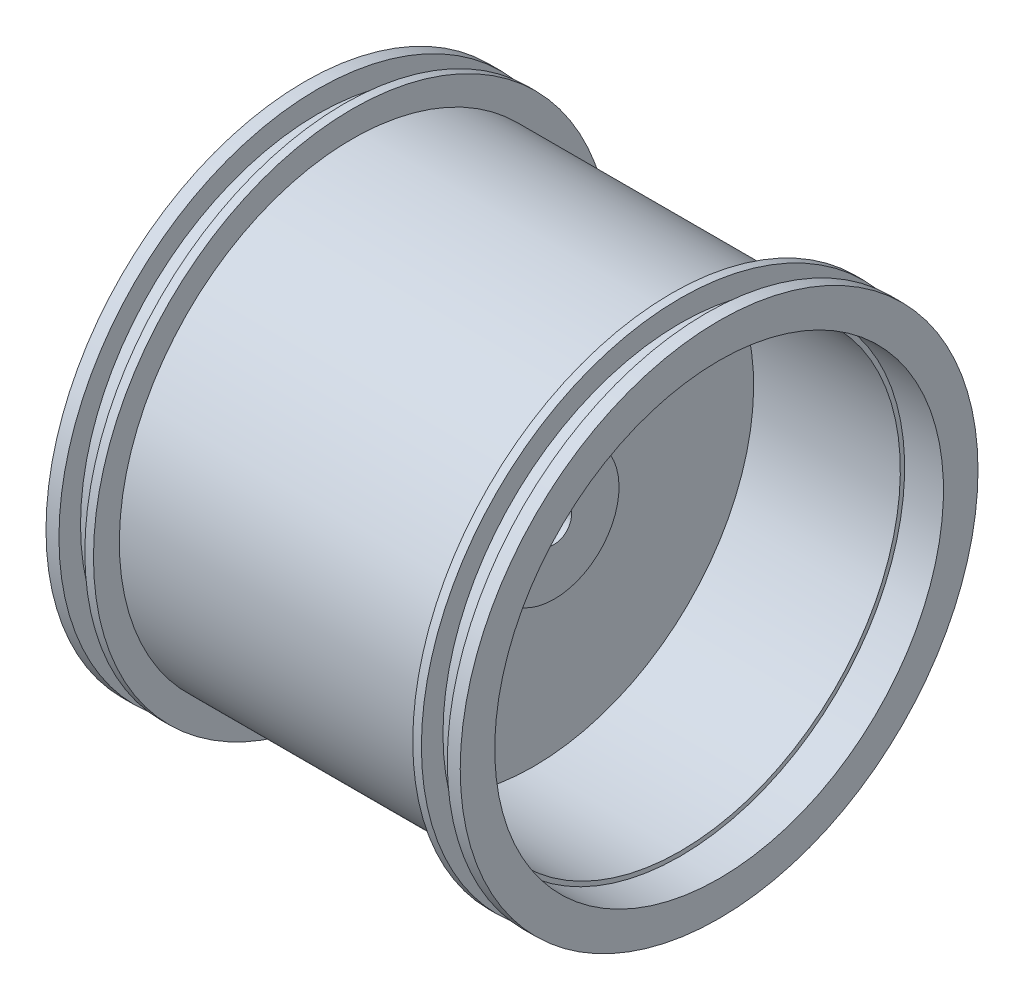
ISO-10303-21;
HEADER;
FILE_DESCRIPTION(('STEP AP214'),'2;1');
FILE_NAME('part.step','',(''),(''),'','','');
FILE_SCHEMA(('AUTOMOTIVE_DESIGN { 1 0 10303 214 1 1 1 1 }'));
ENDSEC;
DATA;
#1=APPLICATION_CONTEXT('core data for automotive mechanical design processes');
#2=APPLICATION_PROTOCOL_DEFINITION('international standard','automotive_design',2000,#1);
#3=PRODUCT_CONTEXT('',#1,'mechanical');
#4=PRODUCT('Part','Part','',(#3));
#5=PRODUCT_RELATED_PRODUCT_CATEGORY('part','',(#4));
#6=PRODUCT_DEFINITION_FORMATION('','',#4);
#7=PRODUCT_DEFINITION_CONTEXT('part definition',#1,'design');
#8=PRODUCT_DEFINITION('design','',#6,#7);
#9=PRODUCT_DEFINITION_SHAPE('','',#8);
#10=(LENGTH_UNIT() NAMED_UNIT(*) SI_UNIT(.MILLI.,.METRE.));
#11=(NAMED_UNIT(*) PLANE_ANGLE_UNIT() SI_UNIT($,.RADIAN.));
#12=(NAMED_UNIT(*) SI_UNIT($,.STERADIAN.) SOLID_ANGLE_UNIT());
#13=UNCERTAINTY_MEASURE_WITH_UNIT(LENGTH_MEASURE(1.E-05),#10,'distance_accuracy_value','');
#14=(GEOMETRIC_REPRESENTATION_CONTEXT(3) GLOBAL_UNCERTAINTY_ASSIGNED_CONTEXT((#13)) GLOBAL_UNIT_ASSIGNED_CONTEXT((#10,
#11,#12)) REPRESENTATION_CONTEXT('',''));
#15=CARTESIAN_POINT('',(0.,0.,0.));
#16=DIRECTION('',(0.,0.,1.));
#17=DIRECTION('',(1.,0.,0.));
#18=AXIS2_PLACEMENT_3D('',#15,#16,#17);
#19=CARTESIAN_POINT('',(-24.001,0.,0.));
#20=DIRECTION('',(1.,0.,0.));
#21=DIRECTION('',(0.,1.,0.));
#22=AXIS2_PLACEMENT_3D('',#19,#20,#21);
#23=CYLINDRICAL_SURFACE('',#22,2.);
#24=CARTESIAN_POINT('',(4.9,0.,0.));
#25=DIRECTION('',(1.,0.,0.));
#26=DIRECTION('',(0.,1.,0.));
#27=AXIS2_PLACEMENT_3D('',#24,#25,#26);
#28=CIRCLE('',#27,2.);
#29=CARTESIAN_POINT('',(4.9,2.,0.));
#30=VERTEX_POINT('',#29);
#31=EDGE_CURVE('E225',#30,#30,#28,.T.);
#32=ORIENTED_EDGE('',*,*,#31,.T.);
#33=EDGE_LOOP('',(#32));
#34=FACE_BOUND('',#33,.T.);
#35=CARTESIAN_POINT('',(-4.9,0.,0.));
#36=DIRECTION('',(-1.,0.,0.));
#37=DIRECTION('',(0.,0.,1.));
#38=AXIS2_PLACEMENT_3D('',#35,#36,#37);
#39=CIRCLE('',#38,2.);
#40=CARTESIAN_POINT('',(-4.9,0.,2.));
#41=VERTEX_POINT('',#40);
#42=EDGE_CURVE('E38',#41,#41,#39,.F.);
#43=ORIENTED_EDGE('',*,*,#42,.F.);
#44=EDGE_LOOP('',(#43));
#45=FACE_BOUND('',#44,.T.);
#46=ADVANCED_FACE('F34',(#34,#45),#23,.F.);
#47=CARTESIAN_POINT('',(-2.5,-21.838918543533,0.));
#48=DIRECTION('',(1.,0.,0.));
#49=DIRECTION('',(0.,1.,0.));
#50=AXIS2_PLACEMENT_3D('',#47,#48,#49);
#51=PLANE('',#50);
#52=CARTESIAN_POINT('',(-2.5,0.,0.));
#53=DIRECTION('',(-1.,0.,0.));
#54=DIRECTION('',(0.,-1.,0.));
#55=AXIS2_PLACEMENT_3D('',#52,#53,#54);
#56=CIRCLE('',#55,25.5);
#57=CARTESIAN_POINT('',(-2.50000000000001,-25.5,0.));
#58=VERTEX_POINT('',#57);
#59=EDGE_CURVE('E228',#58,#58,#56,.T.);
#60=ORIENTED_EDGE('',*,*,#59,.T.);
#61=EDGE_LOOP('',(#60));
#62=FACE_BOUND('',#61,.T.);
#63=DIRECTION('',(0.,0.5,-0.866025403784439));
#64=VECTOR('',#63,1.);
#65=CARTESIAN_POINT('',(-2.5,4.12805442470583,7.15));
#66=LINE('',#65,#64);
#67=CARTESIAN_POINT('',(-2.5,4.12805442470583,7.15));
#68=VERTEX_POINT('',#67);
#69=CARTESIAN_POINT('',(-2.5,8.25610884941166,0.));
#70=VERTEX_POINT('',#69);
#71=EDGE_CURVE('E194',#68,#70,#66,.T.);
#72=ORIENTED_EDGE('',*,*,#71,.F.);
#73=DIRECTION('',(0.,1.,0.));
#74=VECTOR('',#73,1.);
#75=CARTESIAN_POINT('',(-2.5,-4.12805442470582,7.15));
#76=LINE('',#75,#74);
#77=CARTESIAN_POINT('',(-2.5,-4.12805442470582,7.15));
#78=VERTEX_POINT('',#77);
#79=EDGE_CURVE('E183',#78,#68,#76,.T.);
#80=ORIENTED_EDGE('',*,*,#79,.F.);
#81=DIRECTION('',(0.,0.5,0.866025403784439));
#82=VECTOR('',#81,1.);
#83=CARTESIAN_POINT('',(-2.5,-8.25610884941165,0.));
#84=LINE('',#83,#82);
#85=CARTESIAN_POINT('',(-2.5,-8.25610884941165,0.));
#86=VERTEX_POINT('',#85);
#87=EDGE_CURVE('E204',#86,#78,#84,.T.);
#88=ORIENTED_EDGE('',*,*,#87,.F.);
#89=DIRECTION('',(0.,-0.5,0.866025403784438));
#90=VECTOR('',#89,1.);
#91=CARTESIAN_POINT('',(-2.5,-4.12805442470582,-7.15));
#92=LINE('',#91,#90);
#93=CARTESIAN_POINT('',(-2.5,-4.12805442470583,-7.15));
#94=VERTEX_POINT('',#93);
#95=EDGE_CURVE('E201',#94,#86,#92,.T.);
#96=ORIENTED_EDGE('',*,*,#95,.F.);
#97=DIRECTION('',(0.,-1.,0.));
#98=VECTOR('',#97,1.);
#99=CARTESIAN_POINT('',(-2.5,4.12805442470582,-7.15));
#100=LINE('',#99,#98);
#101=CARTESIAN_POINT('',(-2.5,4.12805442470582,-7.15));
#102=VERTEX_POINT('',#101);
#103=EDGE_CURVE('E198',#102,#94,#100,.T.);
#104=ORIENTED_EDGE('',*,*,#103,.F.);
#105=DIRECTION('',(0.,-0.5,-0.866025403784438));
#106=VECTOR('',#105,1.);
#107=CARTESIAN_POINT('',(-2.5,8.25610884941165,0.));
#108=LINE('',#107,#106);
#109=EDGE_CURVE('E58',#70,#102,#108,.T.);
#110=ORIENTED_EDGE('',*,*,#109,.F.);
#111=EDGE_LOOP('',(#72,#80,#88,#96,#104,#110));
#112=FACE_BOUND('',#111,.T.);
#113=ADVANCED_FACE('F36',(#62,#112),#51,.F.);
#114=CARTESIAN_POINT('',(4.9,-21.838918543533,0.));
#115=DIRECTION('',(-1.,0.,0.));
#116=DIRECTION('',(0.,-1.,0.));
#117=AXIS2_PLACEMENT_3D('',#114,#115,#116);
#118=PLANE('',#117);
#119=ORIENTED_EDGE('',*,*,#31,.F.);
#120=EDGE_LOOP('',(#119));
#121=FACE_BOUND('',#120,.T.);
#122=CARTESIAN_POINT('',(4.9,0.,0.));
#123=DIRECTION('',(-1.,0.,0.));
#124=DIRECTION('',(0.,-1.,0.));
#125=AXIS2_PLACEMENT_3D('',#122,#123,#124);
#126=CIRCLE('',#125,7.5);
#127=CARTESIAN_POINT('',(4.9,-7.5,0.));
#128=VERTEX_POINT('',#127);
#129=EDGE_CURVE('E11',#128,#128,#126,.T.);
#130=ORIENTED_EDGE('',*,*,#129,.F.);
#131=EDGE_LOOP('',(#130));
#132=FACE_BOUND('',#131,.T.);
#133=ADVANCED_FACE('F302',(#121,#132),#118,.F.);
#134=CARTESIAN_POINT('',(-2.5,0.,0.));
#135=DIRECTION('',(-1.,0.,0.));
#136=DIRECTION('',(0.,-1.,0.));
#137=AXIS2_PLACEMENT_3D('',#134,#135,#136);
#138=CYLINDRICAL_SURFACE('',#137,7.5);
#139=CARTESIAN_POINT('',(2.5,0.,0.));
#140=DIRECTION('',(-1.,0.,0.));
#141=DIRECTION('',(0.,-1.,0.));
#142=AXIS2_PLACEMENT_3D('',#139,#140,#141);
#143=CIRCLE('',#142,7.5);
#144=CARTESIAN_POINT('',(2.5,-7.5,0.));
#145=VERTEX_POINT('',#144);
#146=EDGE_CURVE('E43',#145,#145,#143,.T.);
#147=ORIENTED_EDGE('',*,*,#146,.F.);
#148=EDGE_LOOP('',(#147));
#149=FACE_BOUND('',#148,.T.);
#150=ORIENTED_EDGE('',*,*,#129,.T.);
#151=EDGE_LOOP('',(#150));
#152=FACE_BOUND('',#151,.T.);
#153=ADVANCED_FACE('F299',(#149,#152),#138,.T.);
#154=CARTESIAN_POINT('',(2.5,-21.838918543533,0.));
#155=DIRECTION('',(-1.,0.,0.));
#156=DIRECTION('',(0.,-1.,0.));
#157=AXIS2_PLACEMENT_3D('',#154,#155,#156);
#158=PLANE('',#157);
#159=CARTESIAN_POINT('',(2.5,0.,0.));
#160=DIRECTION('',(-1.,0.,0.));
#161=DIRECTION('',(0.,-1.,0.));
#162=AXIS2_PLACEMENT_3D('',#159,#160,#161);
#163=CIRCLE('',#162,25.5);
#164=CARTESIAN_POINT('',(2.5,-25.5,0.));
#165=VERTEX_POINT('',#164);
#166=EDGE_CURVE('E291',#165,#165,#163,.T.);
#167=ORIENTED_EDGE('',*,*,#166,.F.);
#168=EDGE_LOOP('',(#167));
#169=FACE_BOUND('',#168,.T.);
#170=ORIENTED_EDGE('',*,*,#146,.T.);
#171=EDGE_LOOP('',(#170));
#172=FACE_BOUND('',#171,.T.);
#173=ADVANCED_FACE('F297',(#169,#172),#158,.F.);
#174=CARTESIAN_POINT('',(-2.5,0.,0.));
#175=DIRECTION('',(-1.,0.,0.));
#176=DIRECTION('',(0.,-1.,0.));
#177=AXIS2_PLACEMENT_3D('',#174,#175,#176);
#178=CYLINDRICAL_SURFACE('',#177,25.5);
#179=CARTESIAN_POINT('',(19.5,0.,0.));
#180=DIRECTION('',(-1.,0.,0.));
#181=DIRECTION('',(0.,-1.,0.));
#182=AXIS2_PLACEMENT_3D('',#179,#180,#181);
#183=CIRCLE('',#182,25.5);
#184=CARTESIAN_POINT('',(19.5,-25.5,0.));
#185=VERTEX_POINT('',#184);
#186=EDGE_CURVE('E288',#185,#185,#183,.T.);
#187=ORIENTED_EDGE('',*,*,#186,.F.);
#188=EDGE_LOOP('',(#187));
#189=FACE_BOUND('',#188,.T.);
#190=ORIENTED_EDGE('',*,*,#166,.T.);
#191=EDGE_LOOP('',(#190));
#192=FACE_BOUND('',#191,.T.);
#193=ADVANCED_FACE('F403',(#189,#192),#178,.F.);
#194=CARTESIAN_POINT('',(19.5,-21.838918543533,0.));
#195=DIRECTION('',(-1.,0.,0.));
#196=DIRECTION('',(0.,-1.,0.));
#197=AXIS2_PLACEMENT_3D('',#194,#195,#196);
#198=PLANE('',#197);
#199=CARTESIAN_POINT('',(19.5,0.,0.));
#200=DIRECTION('',(-1.,0.,0.));
#201=DIRECTION('',(0.,-1.,0.));
#202=AXIS2_PLACEMENT_3D('',#199,#200,#201);
#203=CIRCLE('',#202,26.);
#204=CARTESIAN_POINT('',(19.5,-26.,0.));
#205=VERTEX_POINT('',#204);
#206=EDGE_CURVE('E285',#205,#205,#203,.T.);
#207=ORIENTED_EDGE('',*,*,#206,.F.);
#208=EDGE_LOOP('',(#207));
#209=FACE_BOUND('',#208,.T.);
#210=ORIENTED_EDGE('',*,*,#186,.T.);
#211=EDGE_LOOP('',(#210));
#212=FACE_BOUND('',#211,.T.);
#213=ADVANCED_FACE('F399',(#209,#212),#198,.F.);
#214=CARTESIAN_POINT('',(-2.5,0.,0.));
#215=DIRECTION('',(-1.,0.,0.));
#216=DIRECTION('',(0.,-1.,0.));
#217=AXIS2_PLACEMENT_3D('',#214,#215,#216);
#218=CYLINDRICAL_SURFACE('',#217,26.);
#219=CARTESIAN_POINT('',(24.,0.,0.));
#220=DIRECTION('',(-1.,0.,0.));
#221=DIRECTION('',(0.,-1.,0.));
#222=AXIS2_PLACEMENT_3D('',#219,#220,#221);
#223=CIRCLE('',#222,26.);
#224=CARTESIAN_POINT('',(24.,-26.,0.));
#225=VERTEX_POINT('',#224);
#226=EDGE_CURVE('E282',#225,#225,#223,.T.);
#227=ORIENTED_EDGE('',*,*,#226,.F.);
#228=EDGE_LOOP('',(#227));
#229=FACE_BOUND('',#228,.T.);
#230=ORIENTED_EDGE('',*,*,#206,.T.);
#231=EDGE_LOOP('',(#230));
#232=FACE_BOUND('',#231,.T.);
#233=ADVANCED_FACE('F395',(#229,#232),#218,.F.);
#234=CARTESIAN_POINT('',(24.,-21.838918543533,0.));
#235=DIRECTION('',(-1.,0.,0.));
#236=DIRECTION('',(0.,-1.,0.));
#237=AXIS2_PLACEMENT_3D('',#234,#235,#236);
#238=PLANE('',#237);
#239=CARTESIAN_POINT('',(24.,0.,0.));
#240=DIRECTION('',(-1.,0.,0.));
#241=DIRECTION('',(0.,-1.,0.));
#242=AXIS2_PLACEMENT_3D('',#239,#240,#241);
#243=CIRCLE('',#242,30.);
#244=CARTESIAN_POINT('',(24.,-30.,0.));
#245=VERTEX_POINT('',#244);
#246=EDGE_CURVE('E279',#245,#245,#243,.T.);
#247=ORIENTED_EDGE('',*,*,#246,.F.);
#248=EDGE_LOOP('',(#247));
#249=FACE_BOUND('',#248,.T.);
#250=ORIENTED_EDGE('',*,*,#226,.T.);
#251=EDGE_LOOP('',(#250));
#252=FACE_BOUND('',#251,.T.);
#253=ADVANCED_FACE('F391',(#249,#252),#238,.F.);
#254=CARTESIAN_POINT('',(-2.5,0.,0.));
#255=DIRECTION('',(-1.,0.,0.));
#256=DIRECTION('',(0.,-1.,0.));
#257=AXIS2_PLACEMENT_3D('',#254,#255,#256);
#258=CYLINDRICAL_SURFACE('',#257,30.);
#259=CARTESIAN_POINT('',(22.5,0.,0.));
#260=DIRECTION('',(-1.,0.,0.));
#261=DIRECTION('',(0.,-1.,0.));
#262=AXIS2_PLACEMENT_3D('',#259,#260,#261);
#263=CIRCLE('',#262,30.);
#264=CARTESIAN_POINT('',(22.5,-30.,0.));
#265=VERTEX_POINT('',#264);
#266=EDGE_CURVE('E276',#265,#265,#263,.T.);
#267=ORIENTED_EDGE('',*,*,#266,.F.);
#268=EDGE_LOOP('',(#267));
#269=FACE_BOUND('',#268,.T.);
#270=ORIENTED_EDGE('',*,*,#246,.T.);
#271=EDGE_LOOP('',(#270));
#272=FACE_BOUND('',#271,.T.);
#273=ADVANCED_FACE('F387',(#269,#272),#258,.T.);
#274=CARTESIAN_POINT('',(22.5,-21.838918543533,0.));
#275=DIRECTION('',(1.,0.,0.));
#276=DIRECTION('',(0.,1.,0.));
#277=AXIS2_PLACEMENT_3D('',#274,#275,#276);
#278=PLANE('',#277);
#279=CARTESIAN_POINT('',(22.5,0.,0.));
#280=DIRECTION('',(-1.,0.,0.));
#281=DIRECTION('',(0.,-1.,0.));
#282=AXIS2_PLACEMENT_3D('',#279,#280,#281);
#283=CIRCLE('',#282,27.5);
#284=CARTESIAN_POINT('',(22.5,-27.5,0.));
#285=VERTEX_POINT('',#284);
#286=EDGE_CURVE('E273',#285,#285,#283,.T.);
#287=ORIENTED_EDGE('',*,*,#286,.F.);
#288=EDGE_LOOP('',(#287));
#289=FACE_BOUND('',#288,.T.);
#290=ORIENTED_EDGE('',*,*,#266,.T.);
#291=EDGE_LOOP('',(#290));
#292=FACE_BOUND('',#291,.T.);
#293=ADVANCED_FACE('F383',(#289,#292),#278,.F.);
#294=CARTESIAN_POINT('',(-2.5,0.,0.));
#295=DIRECTION('',(-1.,0.,0.));
#296=DIRECTION('',(0.,-1.,0.));
#297=AXIS2_PLACEMENT_3D('',#294,#295,#296);
#298=CYLINDRICAL_SURFACE('',#297,27.5);
#299=CARTESIAN_POINT('',(19.5,0.,0.));
#300=DIRECTION('',(-1.,0.,0.));
#301=DIRECTION('',(0.,-1.,0.));
#302=AXIS2_PLACEMENT_3D('',#299,#300,#301);
#303=CIRCLE('',#302,27.5);
#304=CARTESIAN_POINT('',(19.5,-27.5,0.));
#305=VERTEX_POINT('',#304);
#306=EDGE_CURVE('E270',#305,#305,#303,.T.);
#307=ORIENTED_EDGE('',*,*,#306,.F.);
#308=EDGE_LOOP('',(#307));
#309=FACE_BOUND('',#308,.T.);
#310=ORIENTED_EDGE('',*,*,#286,.T.);
#311=EDGE_LOOP('',(#310));
#312=FACE_BOUND('',#311,.T.);
#313=ADVANCED_FACE('F379',(#309,#312),#298,.T.);
#314=CARTESIAN_POINT('',(19.5,-21.838918543533,0.));
#315=DIRECTION('',(-1.,0.,0.));
#316=DIRECTION('',(0.,-1.,0.));
#317=AXIS2_PLACEMENT_3D('',#314,#315,#316);
#318=PLANE('',#317);
#319=CARTESIAN_POINT('',(19.5,0.,0.));
#320=DIRECTION('',(-1.,0.,0.));
#321=DIRECTION('',(0.,-1.,0.));
#322=AXIS2_PLACEMENT_3D('',#319,#320,#321);
#323=CIRCLE('',#322,30.);
#324=CARTESIAN_POINT('',(19.5,-30.,0.));
#325=VERTEX_POINT('',#324);
#326=EDGE_CURVE('E267',#325,#325,#323,.T.);
#327=ORIENTED_EDGE('',*,*,#326,.F.);
#328=EDGE_LOOP('',(#327));
#329=FACE_BOUND('',#328,.T.);
#330=ORIENTED_EDGE('',*,*,#306,.T.);
#331=EDGE_LOOP('',(#330));
#332=FACE_BOUND('',#331,.T.);
#333=ADVANCED_FACE('F375',(#329,#332),#318,.F.);
#334=CARTESIAN_POINT('',(-2.5,0.,0.));
#335=DIRECTION('',(-1.,0.,0.));
#336=DIRECTION('',(0.,-1.,0.));
#337=AXIS2_PLACEMENT_3D('',#334,#335,#336);
#338=CYLINDRICAL_SURFACE('',#337,30.);
#339=CARTESIAN_POINT('',(18.5,0.,0.));
#340=DIRECTION('',(-1.,0.,0.));
#341=DIRECTION('',(0.,-1.,0.));
#342=AXIS2_PLACEMENT_3D('',#339,#340,#341);
#343=CIRCLE('',#342,30.);
#344=CARTESIAN_POINT('',(18.5,-30.,0.));
#345=VERTEX_POINT('',#344);
#346=EDGE_CURVE('E264',#345,#345,#343,.T.);
#347=ORIENTED_EDGE('',*,*,#346,.F.);
#348=EDGE_LOOP('',(#347));
#349=FACE_BOUND('',#348,.T.);
#350=ORIENTED_EDGE('',*,*,#326,.T.);
#351=EDGE_LOOP('',(#350));
#352=FACE_BOUND('',#351,.T.);
#353=ADVANCED_FACE('F371',(#349,#352),#338,.T.);
#354=CARTESIAN_POINT('',(18.5,-21.838918543533,0.));
#355=DIRECTION('',(1.,0.,0.));
#356=DIRECTION('',(0.,1.,0.));
#357=AXIS2_PLACEMENT_3D('',#354,#355,#356);
#358=PLANE('',#357);
#359=CARTESIAN_POINT('',(18.5,0.,0.));
#360=DIRECTION('',(-1.,0.,0.));
#361=DIRECTION('',(0.,-1.,0.));
#362=AXIS2_PLACEMENT_3D('',#359,#360,#361);
#363=CIRCLE('',#362,27.);
#364=CARTESIAN_POINT('',(18.5,-27.,0.));
#365=VERTEX_POINT('',#364);
#366=EDGE_CURVE('E261',#365,#365,#363,.T.);
#367=ORIENTED_EDGE('',*,*,#366,.F.);
#368=EDGE_LOOP('',(#367));
#369=FACE_BOUND('',#368,.T.);
#370=ORIENTED_EDGE('',*,*,#346,.T.);
#371=EDGE_LOOP('',(#370));
#372=FACE_BOUND('',#371,.T.);
#373=ADVANCED_FACE('F367',(#369,#372),#358,.F.);
#374=CARTESIAN_POINT('',(-2.5,0.,0.));
#375=DIRECTION('',(-1.,0.,0.));
#376=DIRECTION('',(0.,-1.,0.));
#377=AXIS2_PLACEMENT_3D('',#374,#375,#376);
#378=CYLINDRICAL_SURFACE('',#377,27.);
#379=CARTESIAN_POINT('',(-18.5,0.,0.));
#380=DIRECTION('',(-1.,0.,0.));
#381=DIRECTION('',(0.,-1.,0.));
#382=AXIS2_PLACEMENT_3D('',#379,#380,#381);
#383=CIRCLE('',#382,27.);
#384=CARTESIAN_POINT('',(-18.5,-27.,0.));
#385=VERTEX_POINT('',#384);
#386=EDGE_CURVE('E258',#385,#385,#383,.T.);
#387=ORIENTED_EDGE('',*,*,#386,.F.);
#388=EDGE_LOOP('',(#387));
#389=FACE_BOUND('',#388,.T.);
#390=ORIENTED_EDGE('',*,*,#366,.T.);
#391=EDGE_LOOP('',(#390));
#392=FACE_BOUND('',#391,.T.);
#393=ADVANCED_FACE('F363',(#389,#392),#378,.T.);
#394=CARTESIAN_POINT('',(-18.5,-21.838918543533,0.));
#395=DIRECTION('',(1.,0.,0.));
#396=DIRECTION('',(0.,1.,0.));
#397=AXIS2_PLACEMENT_3D('',#394,#395,#396);
#398=PLANE('',#397);
#399=ORIENTED_EDGE('',*,*,#386,.T.);
#400=EDGE_LOOP('',(#399));
#401=FACE_BOUND('',#400,.T.);
#402=CARTESIAN_POINT('',(-18.5,0.,0.));
#403=DIRECTION('',(-1.,0.,0.));
#404=DIRECTION('',(0.,-1.,0.));
#405=AXIS2_PLACEMENT_3D('',#402,#403,#404);
#406=CIRCLE('',#405,30.);
#407=CARTESIAN_POINT('',(-18.5,-30.,0.));
#408=VERTEX_POINT('',#407);
#409=EDGE_CURVE('E255',#408,#408,#406,.T.);
#410=ORIENTED_EDGE('',*,*,#409,.F.);
#411=EDGE_LOOP('',(#410));
#412=FACE_BOUND('',#411,.T.);
#413=ADVANCED_FACE('F359',(#401,#412),#398,.T.);
#414=CARTESIAN_POINT('',(-2.5,0.,0.));
#415=DIRECTION('',(-1.,0.,0.));
#416=DIRECTION('',(0.,-1.,0.));
#417=AXIS2_PLACEMENT_3D('',#414,#415,#416);
#418=CYLINDRICAL_SURFACE('',#417,30.);
#419=ORIENTED_EDGE('',*,*,#409,.T.);
#420=EDGE_LOOP('',(#419));
#421=FACE_BOUND('',#420,.T.);
#422=CARTESIAN_POINT('',(-19.5,0.,0.));
#423=DIRECTION('',(-1.,0.,0.));
#424=DIRECTION('',(0.,-1.,0.));
#425=AXIS2_PLACEMENT_3D('',#422,#423,#424);
#426=CIRCLE('',#425,30.);
#427=CARTESIAN_POINT('',(-19.5,-30.,0.));
#428=VERTEX_POINT('',#427);
#429=EDGE_CURVE('E252',#428,#428,#426,.T.);
#430=ORIENTED_EDGE('',*,*,#429,.F.);
#431=EDGE_LOOP('',(#430));
#432=FACE_BOUND('',#431,.T.);
#433=ADVANCED_FACE('F355',(#421,#432),#418,.T.);
#434=CARTESIAN_POINT('',(-19.5,-21.838918543533,0.));
#435=DIRECTION('',(-1.,0.,0.));
#436=DIRECTION('',(0.,-1.,0.));
#437=AXIS2_PLACEMENT_3D('',#434,#435,#436);
#438=PLANE('',#437);
#439=ORIENTED_EDGE('',*,*,#429,.T.);
#440=EDGE_LOOP('',(#439));
#441=FACE_BOUND('',#440,.T.);
#442=CARTESIAN_POINT('',(-19.5,0.,0.));
#443=DIRECTION('',(-1.,0.,0.));
#444=DIRECTION('',(0.,-1.,0.));
#445=AXIS2_PLACEMENT_3D('',#442,#443,#444);
#446=CIRCLE('',#445,27.5);
#447=CARTESIAN_POINT('',(-19.5,-27.5,0.));
#448=VERTEX_POINT('',#447);
#449=EDGE_CURVE('E249',#448,#448,#446,.T.);
#450=ORIENTED_EDGE('',*,*,#449,.F.);
#451=EDGE_LOOP('',(#450));
#452=FACE_BOUND('',#451,.T.);
#453=ADVANCED_FACE('F351',(#441,#452),#438,.T.);
#454=CARTESIAN_POINT('',(-2.5,0.,0.));
#455=DIRECTION('',(-1.,0.,0.));
#456=DIRECTION('',(0.,-1.,0.));
#457=AXIS2_PLACEMENT_3D('',#454,#455,#456);
#458=CYLINDRICAL_SURFACE('',#457,27.5);
#459=ORIENTED_EDGE('',*,*,#449,.T.);
#460=EDGE_LOOP('',(#459));
#461=FACE_BOUND('',#460,.T.);
#462=CARTESIAN_POINT('',(-22.5,0.,0.));
#463=DIRECTION('',(-1.,0.,0.));
#464=DIRECTION('',(0.,-1.,0.));
#465=AXIS2_PLACEMENT_3D('',#462,#463,#464);
#466=CIRCLE('',#465,27.5);
#467=CARTESIAN_POINT('',(-22.5,-27.5,0.));
#468=VERTEX_POINT('',#467);
#469=EDGE_CURVE('E246',#468,#468,#466,.T.);
#470=ORIENTED_EDGE('',*,*,#469,.F.);
#471=EDGE_LOOP('',(#470));
#472=FACE_BOUND('',#471,.T.);
#473=ADVANCED_FACE('F347',(#461,#472),#458,.T.);
#474=CARTESIAN_POINT('',(-22.5,-21.838918543533,0.));
#475=DIRECTION('',(1.,0.,0.));
#476=DIRECTION('',(0.,1.,0.));
#477=AXIS2_PLACEMENT_3D('',#474,#475,#476);
#478=PLANE('',#477);
#479=ORIENTED_EDGE('',*,*,#469,.T.);
#480=EDGE_LOOP('',(#479));
#481=FACE_BOUND('',#480,.T.);
#482=CARTESIAN_POINT('',(-22.5,0.,0.));
#483=DIRECTION('',(-1.,0.,0.));
#484=DIRECTION('',(0.,-1.,0.));
#485=AXIS2_PLACEMENT_3D('',#482,#483,#484);
#486=CIRCLE('',#485,30.);
#487=CARTESIAN_POINT('',(-22.5,-30.,0.));
#488=VERTEX_POINT('',#487);
#489=EDGE_CURVE('E243',#488,#488,#486,.T.);
#490=ORIENTED_EDGE('',*,*,#489,.F.);
#491=EDGE_LOOP('',(#490));
#492=FACE_BOUND('',#491,.T.);
#493=ADVANCED_FACE('F343',(#481,#492),#478,.T.);
#494=CARTESIAN_POINT('',(-2.5,0.,0.));
#495=DIRECTION('',(-1.,0.,0.));
#496=DIRECTION('',(0.,-1.,0.));
#497=AXIS2_PLACEMENT_3D('',#494,#495,#496);
#498=CYLINDRICAL_SURFACE('',#497,30.);
#499=ORIENTED_EDGE('',*,*,#489,.T.);
#500=EDGE_LOOP('',(#499));
#501=FACE_BOUND('',#500,.T.);
#502=CARTESIAN_POINT('',(-24.,0.,0.));
#503=DIRECTION('',(-1.,0.,0.));
#504=DIRECTION('',(0.,-1.,0.));
#505=AXIS2_PLACEMENT_3D('',#502,#503,#504);
#506=CIRCLE('',#505,30.);
#507=CARTESIAN_POINT('',(-24.,-30.,0.));
#508=VERTEX_POINT('',#507);
#509=EDGE_CURVE('E240',#508,#508,#506,.T.);
#510=ORIENTED_EDGE('',*,*,#509,.F.);
#511=EDGE_LOOP('',(#510));
#512=FACE_BOUND('',#511,.T.);
#513=ADVANCED_FACE('F339',(#501,#512),#498,.T.);
#514=CARTESIAN_POINT('',(-24.,-21.838918543533,0.));
#515=DIRECTION('',(-1.,0.,0.));
#516=DIRECTION('',(0.,-1.,0.));
#517=AXIS2_PLACEMENT_3D('',#514,#515,#516);
#518=PLANE('',#517);
#519=ORIENTED_EDGE('',*,*,#509,.T.);
#520=EDGE_LOOP('',(#519));
#521=FACE_BOUND('',#520,.T.);
#522=CARTESIAN_POINT('',(-24.,0.,0.));
#523=DIRECTION('',(-1.,0.,0.));
#524=DIRECTION('',(0.,-1.,0.));
#525=AXIS2_PLACEMENT_3D('',#522,#523,#524);
#526=CIRCLE('',#525,26.);
#527=CARTESIAN_POINT('',(-24.,-26.,0.));
#528=VERTEX_POINT('',#527);
#529=EDGE_CURVE('E237',#528,#528,#526,.T.);
#530=ORIENTED_EDGE('',*,*,#529,.F.);
#531=EDGE_LOOP('',(#530));
#532=FACE_BOUND('',#531,.T.);
#533=ADVANCED_FACE('F335',(#521,#532),#518,.T.);
#534=CARTESIAN_POINT('',(-2.5,0.,0.));
#535=DIRECTION('',(-1.,0.,0.));
#536=DIRECTION('',(0.,-1.,0.));
#537=AXIS2_PLACEMENT_3D('',#534,#535,#536);
#538=CYLINDRICAL_SURFACE('',#537,26.);
#539=ORIENTED_EDGE('',*,*,#529,.T.);
#540=EDGE_LOOP('',(#539));
#541=FACE_BOUND('',#540,.T.);
#542=CARTESIAN_POINT('',(-19.5,0.,0.));
#543=DIRECTION('',(-1.,0.,0.));
#544=DIRECTION('',(0.,-1.,0.));
#545=AXIS2_PLACEMENT_3D('',#542,#543,#544);
#546=CIRCLE('',#545,26.);
#547=CARTESIAN_POINT('',(-19.5,-26.,0.));
#548=VERTEX_POINT('',#547);
#549=EDGE_CURVE('E234',#548,#548,#546,.T.);
#550=ORIENTED_EDGE('',*,*,#549,.F.);
#551=EDGE_LOOP('',(#550));
#552=FACE_BOUND('',#551,.T.);
#553=ADVANCED_FACE('F331',(#541,#552),#538,.F.);
#554=CARTESIAN_POINT('',(-19.5,-21.838918543533,0.));
#555=DIRECTION('',(-1.,0.,0.));
#556=DIRECTION('',(0.,-1.,0.));
#557=AXIS2_PLACEMENT_3D('',#554,#555,#556);
#558=PLANE('',#557);
#559=ORIENTED_EDGE('',*,*,#549,.T.);
#560=EDGE_LOOP('',(#559));
#561=FACE_BOUND('',#560,.T.);
#562=CARTESIAN_POINT('',(-19.5,0.,0.));
#563=DIRECTION('',(-1.,0.,0.));
#564=DIRECTION('',(0.,-1.,0.));
#565=AXIS2_PLACEMENT_3D('',#562,#563,#564);
#566=CIRCLE('',#565,25.5);
#567=CARTESIAN_POINT('',(-19.5,-25.5,0.));
#568=VERTEX_POINT('',#567);
#569=EDGE_CURVE('E231',#568,#568,#566,.T.);
#570=ORIENTED_EDGE('',*,*,#569,.F.);
#571=EDGE_LOOP('',(#570));
#572=FACE_BOUND('',#571,.T.);
#573=ADVANCED_FACE('F327',(#561,#572),#558,.T.);
#574=CARTESIAN_POINT('',(-2.5,0.,0.));
#575=DIRECTION('',(-1.,0.,0.));
#576=DIRECTION('',(0.,-1.,0.));
#577=AXIS2_PLACEMENT_3D('',#574,#575,#576);
#578=CYLINDRICAL_SURFACE('',#577,25.5);
#579=ORIENTED_EDGE('',*,*,#569,.T.);
#580=EDGE_LOOP('',(#579));
#581=FACE_BOUND('',#580,.T.);
#582=ORIENTED_EDGE('',*,*,#59,.F.);
#583=EDGE_LOOP('',(#582));
#584=FACE_BOUND('',#583,.T.);
#585=ADVANCED_FACE('F323',(#581,#584),#578,.F.);
#586=CARTESIAN_POINT('',(-9.1,8.25610884941165,0.));
#587=DIRECTION('',(-1.,0.,0.));
#588=DIRECTION('',(0.,-1.,0.));
#589=AXIS2_PLACEMENT_3D('',#586,#587,#588);
#590=PLANE('',#589);
#591=DIRECTION('',(0.,1.,0.));
#592=VECTOR('',#591,1.);
#593=CARTESIAN_POINT('',(-9.1,-3.5507041555162,6.15));
#594=LINE('',#593,#592);
#595=CARTESIAN_POINT('',(-9.1,-3.5507041555162,6.15));
#596=VERTEX_POINT('',#595);
#597=CARTESIAN_POINT('',(-9.1,3.5507041555162,6.15));
#598=VERTEX_POINT('',#597);
#599=EDGE_CURVE('E50',#596,#598,#594,.T.);
#600=ORIENTED_EDGE('',*,*,#599,.F.);
#601=DIRECTION('',(0.,0.5,0.866025403784438));
#602=VECTOR('',#601,1.);
#603=CARTESIAN_POINT('',(-9.1,-7.1014083110324,0.));
#604=LINE('',#603,#602);
#605=CARTESIAN_POINT('',(-9.1,-7.1014083110324,0.));
#606=VERTEX_POINT('',#605);
#607=EDGE_CURVE('E146',#606,#596,#604,.T.);
#608=ORIENTED_EDGE('',*,*,#607,.F.);
#609=DIRECTION('',(0.,-0.5,0.866025403784439));
#610=VECTOR('',#609,1.);
#611=CARTESIAN_POINT('',(-9.1,-3.5507041555162,-6.15));
#612=LINE('',#611,#610);
#613=CARTESIAN_POINT('',(-9.1,-3.5507041555162,-6.15));
#614=VERTEX_POINT('',#613);
#615=EDGE_CURVE('E149',#614,#606,#612,.T.);
#616=ORIENTED_EDGE('',*,*,#615,.F.);
#617=DIRECTION('',(0.,-1.,0.));
#618=VECTOR('',#617,1.);
#619=CARTESIAN_POINT('',(-9.1,3.5507041555162,-6.15));
#620=LINE('',#619,#618);
#621=CARTESIAN_POINT('',(-9.1,3.5507041555162,-6.15));
#622=VERTEX_POINT('',#621);
#623=EDGE_CURVE('E165',#622,#614,#620,.T.);
#624=ORIENTED_EDGE('',*,*,#623,.F.);
#625=DIRECTION('',(0.,-0.5,-0.866025403784438));
#626=VECTOR('',#625,1.);
#627=CARTESIAN_POINT('',(-9.1,7.1014083110324,0.));
#628=LINE('',#627,#626);
#629=CARTESIAN_POINT('',(-9.1,7.1014083110324,0.));
#630=VERTEX_POINT('',#629);
#631=EDGE_CURVE('E162',#630,#622,#628,.T.);
#632=ORIENTED_EDGE('',*,*,#631,.F.);
#633=DIRECTION('',(0.,0.5,-0.866025403784439));
#634=VECTOR('',#633,1.);
#635=CARTESIAN_POINT('',(-9.1,3.5507041555162,6.15));
#636=LINE('',#635,#634);
#637=EDGE_CURVE('E160',#598,#630,#636,.T.);
#638=ORIENTED_EDGE('',*,*,#637,.F.);
#639=EDGE_LOOP('',(#600,#608,#616,#624,#632,#638));
#640=FACE_BOUND('',#639,.T.);
#641=DIRECTION('',(0.,0.5,-0.866025403784439));
#642=VECTOR('',#641,1.);
#643=CARTESIAN_POINT('',(-9.1,4.12805442470583,7.15));
#644=LINE('',#643,#642);
#645=CARTESIAN_POINT('',(-9.1,4.12805442470583,7.15));
#646=VERTEX_POINT('',#645);
#647=CARTESIAN_POINT('',(-9.1,8.25610884941165,0.));
#648=VERTEX_POINT('',#647);
#649=EDGE_CURVE('E179',#646,#648,#644,.T.);
#650=ORIENTED_EDGE('',*,*,#649,.T.);
#651=DIRECTION('',(0.,-0.5,-0.866025403784438));
#652=VECTOR('',#651,1.);
#653=CARTESIAN_POINT('',(-9.1,8.25610884941165,0.));
#654=LINE('',#653,#652);
#655=CARTESIAN_POINT('',(-9.1,4.12805442470582,-7.15));
#656=VERTEX_POINT('',#655);
#657=EDGE_CURVE('E182',#648,#656,#654,.T.);
#658=ORIENTED_EDGE('',*,*,#657,.T.);
#659=DIRECTION('',(0.,-1.,0.));
#660=VECTOR('',#659,1.);
#661=CARTESIAN_POINT('',(-9.1,4.12805442470582,-7.15));
#662=LINE('',#661,#660);
#663=CARTESIAN_POINT('',(-9.1,-4.12805442470582,-7.15));
#664=VERTEX_POINT('',#663);
#665=EDGE_CURVE('E185',#656,#664,#662,.T.);
#666=ORIENTED_EDGE('',*,*,#665,.T.);
#667=DIRECTION('',(0.,-0.5,0.866025403784438));
#668=VECTOR('',#667,1.);
#669=CARTESIAN_POINT('',(-9.1,-4.12805442470582,-7.15));
#670=LINE('',#669,#668);
#671=CARTESIAN_POINT('',(-9.1,-8.25610884941165,0.));
#672=VERTEX_POINT('',#671);
#673=EDGE_CURVE('E187',#664,#672,#670,.T.);
#674=ORIENTED_EDGE('',*,*,#673,.T.);
#675=DIRECTION('',(0.,0.5,0.866025403784439));
#676=VECTOR('',#675,1.);
#677=CARTESIAN_POINT('',(-9.1,-8.25610884941165,0.));
#678=LINE('',#677,#676);
#679=CARTESIAN_POINT('',(-9.1,-4.12805442470582,7.15));
#680=VERTEX_POINT('',#679);
#681=EDGE_CURVE('E189',#672,#680,#678,.T.);
#682=ORIENTED_EDGE('',*,*,#681,.T.);
#683=DIRECTION('',(0.,1.,0.));
#684=VECTOR('',#683,1.);
#685=CARTESIAN_POINT('',(-9.1,-4.12805442470582,7.15));
#686=LINE('',#685,#684);
#687=EDGE_CURVE('E191',#680,#646,#686,.T.);
#688=ORIENTED_EDGE('',*,*,#687,.T.);
#689=EDGE_LOOP('',(#650,#658,#666,#674,#682,#688));
#690=FACE_BOUND('',#689,.T.);
#691=ADVANCED_FACE('F326',(#640,#690),#590,.T.);
#692=CARTESIAN_POINT('',(-9.1,4.12805442470583,7.15));
#693=DIRECTION('',(0.,-0.866025403784439,-0.5));
#694=DIRECTION('',(0.,0.5,-0.866025403784438));
#695=AXIS2_PLACEMENT_3D('',#692,#693,#694);
#696=PLANE('',#695);
#697=ORIENTED_EDGE('',*,*,#71,.T.);
#698=DIRECTION('',(1.,0.,0.));
#699=VECTOR('',#698,1.);
#700=CARTESIAN_POINT('',(-9.1,8.25610884941165,0.));
#701=LINE('',#700,#699);
#702=EDGE_CURVE('E223',#648,#70,#701,.T.);
#703=ORIENTED_EDGE('',*,*,#702,.F.);
#704=ORIENTED_EDGE('',*,*,#649,.F.);
#705=DIRECTION('',(1.,0.,0.));
#706=VECTOR('',#705,1.);
#707=CARTESIAN_POINT('',(-9.1,4.12805442470583,7.15));
#708=LINE('',#707,#706);
#709=EDGE_CURVE('E193',#646,#68,#708,.T.);
#710=ORIENTED_EDGE('',*,*,#709,.T.);
#711=EDGE_LOOP('',(#697,#703,#704,#710));
#712=FACE_BOUND('',#711,.T.);
#713=ADVANCED_FACE('F321',(#712),#696,.F.);
#714=CARTESIAN_POINT('',(-9.1,8.25610884941165,0.));
#715=DIRECTION('',(0.,-0.866025403784438,0.5));
#716=DIRECTION('',(0.,-0.5,-0.866025403784438));
#717=AXIS2_PLACEMENT_3D('',#714,#715,#716);
#718=PLANE('',#717);
#719=ORIENTED_EDGE('',*,*,#109,.T.);
#720=DIRECTION('',(1.,0.,0.));
#721=VECTOR('',#720,1.);
#722=CARTESIAN_POINT('',(-9.1,4.12805442470582,-7.15));
#723=LINE('',#722,#721);
#724=EDGE_CURVE('E220',#656,#102,#723,.T.);
#725=ORIENTED_EDGE('',*,*,#724,.F.);
#726=ORIENTED_EDGE('',*,*,#657,.F.);
#727=ORIENTED_EDGE('',*,*,#702,.T.);
#728=EDGE_LOOP('',(#719,#725,#726,#727));
#729=FACE_BOUND('',#728,.T.);
#730=ADVANCED_FACE('F514',(#729),#718,.F.);
#731=CARTESIAN_POINT('',(-9.1,4.12805442470582,-7.15));
#732=DIRECTION('',(0.,0.,1.));
#733=DIRECTION('',(1.,0.,0.));
#734=AXIS2_PLACEMENT_3D('',#731,#732,#733);
#735=PLANE('',#734);
#736=ORIENTED_EDGE('',*,*,#103,.T.);
#737=DIRECTION('',(1.,0.,0.));
#738=VECTOR('',#737,1.);
#739=CARTESIAN_POINT('',(-9.1,-4.12805442470582,-7.15));
#740=LINE('',#739,#738);
#741=EDGE_CURVE('E217',#664,#94,#740,.T.);
#742=ORIENTED_EDGE('',*,*,#741,.F.);
#743=ORIENTED_EDGE('',*,*,#665,.F.);
#744=ORIENTED_EDGE('',*,*,#724,.T.);
#745=EDGE_LOOP('',(#736,#742,#743,#744));
#746=FACE_BOUND('',#745,.T.);
#747=ADVANCED_FACE('F522',(#746),#735,.F.);
#748=CARTESIAN_POINT('',(-9.1,-4.12805442470582,-7.15));
#749=DIRECTION('',(0.,0.866025403784438,0.5));
#750=DIRECTION('',(0.,-0.5,0.866025403784439));
#751=AXIS2_PLACEMENT_3D('',#748,#749,#750);
#752=PLANE('',#751);
#753=ORIENTED_EDGE('',*,*,#95,.T.);
#754=DIRECTION('',(1.,0.,0.));
#755=VECTOR('',#754,1.);
#756=CARTESIAN_POINT('',(-9.1,-8.25610884941165,0.));
#757=LINE('',#756,#755);
#758=EDGE_CURVE('E214',#672,#86,#757,.T.);
#759=ORIENTED_EDGE('',*,*,#758,.F.);
#760=ORIENTED_EDGE('',*,*,#673,.F.);
#761=ORIENTED_EDGE('',*,*,#741,.T.);
#762=EDGE_LOOP('',(#753,#759,#760,#761));
#763=FACE_BOUND('',#762,.T.);
#764=ADVANCED_FACE('F529',(#763),#752,.F.);
#765=CARTESIAN_POINT('',(-9.1,-8.25610884941165,0.));
#766=DIRECTION('',(0.,0.866025403784439,-0.5));
#767=DIRECTION('',(0.,0.5,0.866025403784439));
#768=AXIS2_PLACEMENT_3D('',#765,#766,#767);
#769=PLANE('',#768);
#770=ORIENTED_EDGE('',*,*,#87,.T.);
#771=DIRECTION('',(1.,0.,0.));
#772=VECTOR('',#771,1.);
#773=CARTESIAN_POINT('',(-9.1,-4.12805442470582,7.15));
#774=LINE('',#773,#772);
#775=EDGE_CURVE('E211',#680,#78,#774,.T.);
#776=ORIENTED_EDGE('',*,*,#775,.F.);
#777=ORIENTED_EDGE('',*,*,#681,.F.);
#778=ORIENTED_EDGE('',*,*,#758,.T.);
#779=EDGE_LOOP('',(#770,#776,#777,#778));
#780=FACE_BOUND('',#779,.T.);
#781=ADVANCED_FACE('F537',(#780),#769,.F.);
#782=CARTESIAN_POINT('',(-9.1,-4.12805442470582,7.15));
#783=DIRECTION('',(0.,0.,-1.));
#784=DIRECTION('',(0.,1.,0.));
#785=AXIS2_PLACEMENT_3D('',#782,#783,#784);
#786=PLANE('',#785);
#787=ORIENTED_EDGE('',*,*,#79,.T.);
#788=ORIENTED_EDGE('',*,*,#709,.F.);
#789=ORIENTED_EDGE('',*,*,#687,.F.);
#790=ORIENTED_EDGE('',*,*,#775,.T.);
#791=EDGE_LOOP('',(#787,#788,#789,#790));
#792=FACE_BOUND('',#791,.T.);
#793=ADVANCED_FACE('F545',(#792),#786,.F.);
#794=CARTESIAN_POINT('',(-4.9,3.5507041555162,6.15));
#795=DIRECTION('',(-1.,0.,0.));
#796=DIRECTION('',(0.,0.,1.));
#797=AXIS2_PLACEMENT_3D('',#794,#795,#796);
#798=PLANE('',#797);
#799=DIRECTION('',(0.,1.,0.));
#800=VECTOR('',#799,1.);
#801=CARTESIAN_POINT('',(-4.9,-3.5507041555162,6.15));
#802=LINE('',#801,#800);
#803=CARTESIAN_POINT('',(-4.9,-3.5507041555162,6.15));
#804=VERTEX_POINT('',#803);
#805=CARTESIAN_POINT('',(-4.9,3.5507041555162,6.15));
#806=VERTEX_POINT('',#805);
#807=EDGE_CURVE('E126',#804,#806,#802,.T.);
#808=ORIENTED_EDGE('',*,*,#807,.T.);
#809=DIRECTION('',(0.,0.5,-0.866025403784439));
#810=VECTOR('',#809,1.);
#811=CARTESIAN_POINT('',(-4.9,3.5507041555162,6.15));
#812=LINE('',#811,#810);
#813=CARTESIAN_POINT('',(-4.9,7.1014083110324,0.));
#814=VERTEX_POINT('',#813);
#815=EDGE_CURVE('E135',#806,#814,#812,.T.);
#816=ORIENTED_EDGE('',*,*,#815,.T.);
#817=DIRECTION('',(0.,-0.5,-0.866025403784438));
#818=VECTOR('',#817,1.);
#819=CARTESIAN_POINT('',(-4.9,7.1014083110324,0.));
#820=LINE('',#819,#818);
#821=CARTESIAN_POINT('',(-4.9,3.5507041555162,-6.15));
#822=VERTEX_POINT('',#821);
#823=EDGE_CURVE('E140',#814,#822,#820,.T.);
#824=ORIENTED_EDGE('',*,*,#823,.T.);
#825=DIRECTION('',(0.,-1.,0.));
#826=VECTOR('',#825,1.);
#827=CARTESIAN_POINT('',(-4.9,3.5507041555162,-6.15));
#828=LINE('',#827,#826);
#829=CARTESIAN_POINT('',(-4.9,-3.5507041555162,-6.15));
#830=VERTEX_POINT('',#829);
#831=EDGE_CURVE('E153',#822,#830,#828,.T.);
#832=ORIENTED_EDGE('',*,*,#831,.T.);
#833=DIRECTION('',(0.,-0.5,0.866025403784439));
#834=VECTOR('',#833,1.);
#835=CARTESIAN_POINT('',(-4.9,-3.5507041555162,-6.15));
#836=LINE('',#835,#834);
#837=CARTESIAN_POINT('',(-4.9,-7.1014083110324,0.));
#838=VERTEX_POINT('',#837);
#839=EDGE_CURVE('E156',#830,#838,#836,.T.);
#840=ORIENTED_EDGE('',*,*,#839,.T.);
#841=DIRECTION('',(0.,0.5,0.866025403784438));
#842=VECTOR('',#841,1.);
#843=CARTESIAN_POINT('',(-4.9,-7.1014083110324,0.));
#844=LINE('',#843,#842);
#845=EDGE_CURVE('E132',#838,#804,#844,.T.);
#846=ORIENTED_EDGE('',*,*,#845,.T.);
#847=EDGE_LOOP('',(#808,#816,#824,#832,#840,#846));
#848=FACE_BOUND('',#847,.T.);
#849=ORIENTED_EDGE('',*,*,#42,.T.);
#850=EDGE_LOOP('',(#849));
#851=FACE_BOUND('',#850,.T.);
#852=ADVANCED_FACE('F142',(#848,#851),#798,.T.);
#853=CARTESIAN_POINT('',(-4.9,-3.5507041555162,6.15));
#854=DIRECTION('',(0.,0.,1.));
#855=DIRECTION('',(1.,0.,0.));
#856=AXIS2_PLACEMENT_3D('',#853,#854,#855);
#857=PLANE('',#856);
#858=ORIENTED_EDGE('',*,*,#599,.T.);
#859=DIRECTION('',(-1.,0.,0.));
#860=VECTOR('',#859,1.);
#861=CARTESIAN_POINT('',(-4.9,3.5507041555162,6.15));
#862=LINE('',#861,#860);
#863=EDGE_CURVE('E122',#806,#598,#862,.T.);
#864=ORIENTED_EDGE('',*,*,#863,.F.);
#865=ORIENTED_EDGE('',*,*,#807,.F.);
#866=DIRECTION('',(-1.,0.,0.));
#867=VECTOR('',#866,1.);
#868=CARTESIAN_POINT('',(-4.9,-3.5507041555162,6.15));
#869=LINE('',#868,#867);
#870=EDGE_CURVE('E170',#804,#596,#869,.T.);
#871=ORIENTED_EDGE('',*,*,#870,.T.);
#872=EDGE_LOOP('',(#858,#864,#865,#871));
#873=FACE_BOUND('',#872,.T.);
#874=ADVANCED_FACE('F124',(#873),#857,.F.);
#875=CARTESIAN_POINT('',(-4.9,-7.1014083110324,0.));
#876=DIRECTION('',(0.,-0.866025403784439,0.5));
#877=DIRECTION('',(0.,-0.5,-0.866025403784439));
#878=AXIS2_PLACEMENT_3D('',#875,#876,#877);
#879=PLANE('',#878);
#880=ORIENTED_EDGE('',*,*,#607,.T.);
#881=ORIENTED_EDGE('',*,*,#870,.F.);
#882=ORIENTED_EDGE('',*,*,#845,.F.);
#883=DIRECTION('',(-1.,0.,0.));
#884=VECTOR('',#883,1.);
#885=CARTESIAN_POINT('',(-4.9,-7.1014083110324,0.));
#886=LINE('',#885,#884);
#887=EDGE_CURVE('E172',#838,#606,#886,.T.);
#888=ORIENTED_EDGE('',*,*,#887,.T.);
#889=EDGE_LOOP('',(#880,#881,#882,#888));
#890=FACE_BOUND('',#889,.T.);
#891=ADVANCED_FACE('F565',(#890),#879,.F.);
#892=CARTESIAN_POINT('',(-4.9,-3.5507041555162,-6.15));
#893=DIRECTION('',(0.,-0.866025403784439,-0.5));
#894=DIRECTION('',(0.,0.5,-0.866025403784439));
#895=AXIS2_PLACEMENT_3D('',#892,#893,#894);
#896=PLANE('',#895);
#897=ORIENTED_EDGE('',*,*,#615,.T.);
#898=ORIENTED_EDGE('',*,*,#887,.F.);
#899=ORIENTED_EDGE('',*,*,#839,.F.);
#900=DIRECTION('',(-1.,0.,0.));
#901=VECTOR('',#900,1.);
#902=CARTESIAN_POINT('',(-4.9,-3.5507041555162,-6.15));
#903=LINE('',#902,#901);
#904=EDGE_CURVE('E174',#830,#614,#903,.T.);
#905=ORIENTED_EDGE('',*,*,#904,.T.);
#906=EDGE_LOOP('',(#897,#898,#899,#905));
#907=FACE_BOUND('',#906,.T.);
#908=ADVANCED_FACE('F572',(#907),#896,.F.);
#909=CARTESIAN_POINT('',(-4.9,3.5507041555162,-6.15));
#910=DIRECTION('',(0.,0.,-1.));
#911=DIRECTION('',(-1.,0.,0.));
#912=AXIS2_PLACEMENT_3D('',#909,#910,#911);
#913=PLANE('',#912);
#914=ORIENTED_EDGE('',*,*,#623,.T.);
#915=ORIENTED_EDGE('',*,*,#904,.F.);
#916=ORIENTED_EDGE('',*,*,#831,.F.);
#917=DIRECTION('',(-1.,0.,0.));
#918=VECTOR('',#917,1.);
#919=CARTESIAN_POINT('',(-4.9,3.5507041555162,-6.15));
#920=LINE('',#919,#918);
#921=EDGE_CURVE('E176',#822,#622,#920,.T.);
#922=ORIENTED_EDGE('',*,*,#921,.T.);
#923=EDGE_LOOP('',(#914,#915,#916,#922));
#924=FACE_BOUND('',#923,.T.);
#925=ADVANCED_FACE('F580',(#924),#913,.F.);
#926=CARTESIAN_POINT('',(-4.9,7.1014083110324,0.));
#927=DIRECTION('',(0.,0.866025403784439,-0.5));
#928=DIRECTION('',(0.,0.5,0.866025403784439));
#929=AXIS2_PLACEMENT_3D('',#926,#927,#928);
#930=PLANE('',#929);
#931=ORIENTED_EDGE('',*,*,#631,.T.);
#932=ORIENTED_EDGE('',*,*,#921,.F.);
#933=ORIENTED_EDGE('',*,*,#823,.F.);
#934=DIRECTION('',(-1.,0.,0.));
#935=VECTOR('',#934,1.);
#936=CARTESIAN_POINT('',(-4.9,7.1014083110324,0.));
#937=LINE('',#936,#935);
#938=EDGE_CURVE('E131',#814,#630,#937,.T.);
#939=ORIENTED_EDGE('',*,*,#938,.T.);
#940=EDGE_LOOP('',(#931,#932,#933,#939));
#941=FACE_BOUND('',#940,.T.);
#942=ADVANCED_FACE('F588',(#941),#930,.F.);
#943=CARTESIAN_POINT('',(-4.9,3.5507041555162,6.15));
#944=DIRECTION('',(0.,0.866025403784439,0.5));
#945=DIRECTION('',(0.,-0.5,0.866025403784439));
#946=AXIS2_PLACEMENT_3D('',#943,#944,#945);
#947=PLANE('',#946);
#948=ORIENTED_EDGE('',*,*,#637,.T.);
#949=ORIENTED_EDGE('',*,*,#938,.F.);
#950=ORIENTED_EDGE('',*,*,#815,.F.);
#951=ORIENTED_EDGE('',*,*,#863,.T.);
#952=EDGE_LOOP('',(#948,#949,#950,#951));
#953=FACE_BOUND('',#952,.T.);
#954=ADVANCED_FACE('F136',(#953),#947,.F.);
#955=CLOSED_SHELL('',(#46,#113,#133,#153,#173,#193,#213,#233,#253,#273,#293,#313,#333,#353,#373,
#393,#413,#433,#453,#473,#493,#513,#533,#553,#573,#585,#691,#713,#730,#747,#764,#781,#793,#852,
#874,#891,#908,#925,#942,#954));
#956=MANIFOLD_SOLID_BREP('B2',#955);
#957=ADVANCED_BREP_SHAPE_REPRESENTATION('',(#18,#956),#14);
#958=SHAPE_DEFINITION_REPRESENTATION(#9,#957);
ENDSEC;
END-ISO-10303-21;
